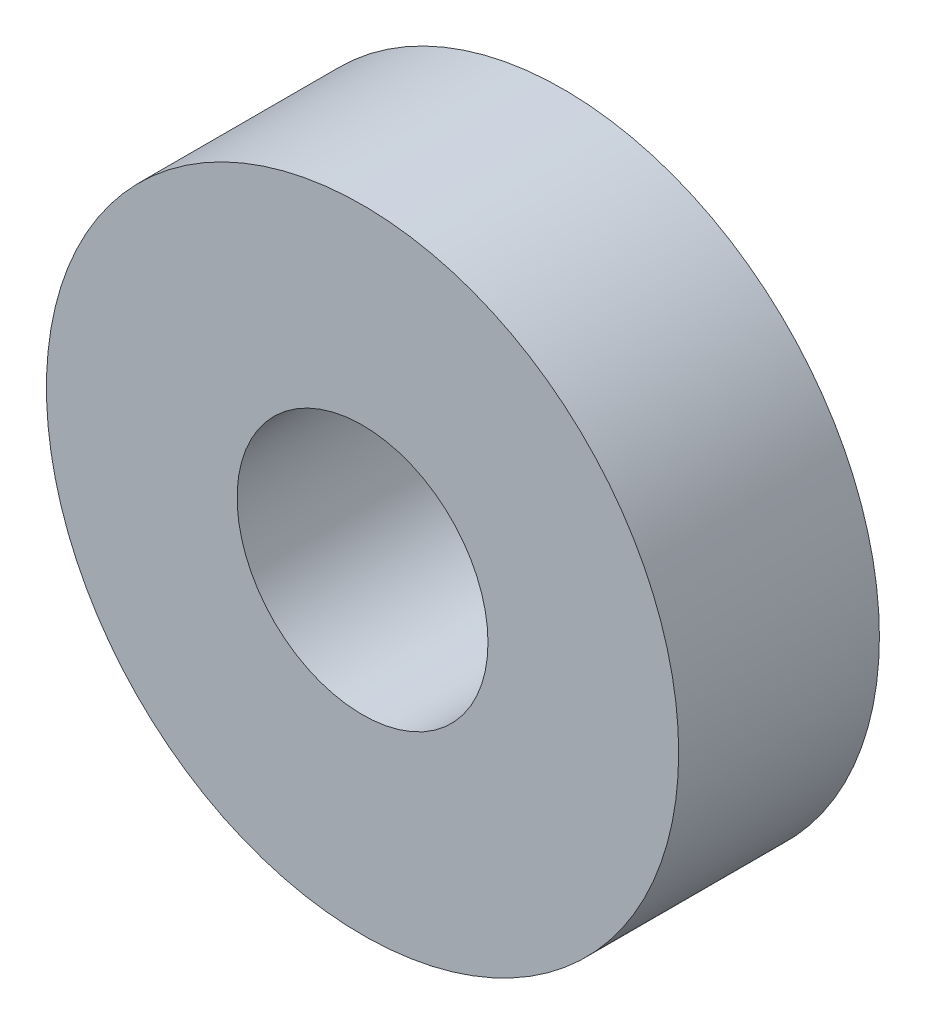
ISO-10303-21;
HEADER;
FILE_DESCRIPTION(('STEP AP214'),'2;1');
FILE_NAME('part.step','',(''),(''),'','','');
FILE_SCHEMA(('AUTOMOTIVE_DESIGN { 1 0 10303 214 1 1 1 1 }'));
ENDSEC;
DATA;
#1=APPLICATION_CONTEXT('core data for automotive mechanical design processes');
#2=APPLICATION_PROTOCOL_DEFINITION('international standard','automotive_design',2000,#1);
#3=PRODUCT_CONTEXT('',#1,'mechanical');
#4=PRODUCT('Part','Part','',(#3));
#5=PRODUCT_RELATED_PRODUCT_CATEGORY('part','',(#4));
#6=PRODUCT_DEFINITION_FORMATION('','',#4);
#7=PRODUCT_DEFINITION_CONTEXT('part definition',#1,'design');
#8=PRODUCT_DEFINITION('design','',#6,#7);
#9=PRODUCT_DEFINITION_SHAPE('','',#8);
#10=(LENGTH_UNIT() NAMED_UNIT(*) SI_UNIT(.MILLI.,.METRE.));
#11=(NAMED_UNIT(*) PLANE_ANGLE_UNIT() SI_UNIT($,.RADIAN.));
#12=(NAMED_UNIT(*) SI_UNIT($,.STERADIAN.) SOLID_ANGLE_UNIT());
#13=UNCERTAINTY_MEASURE_WITH_UNIT(LENGTH_MEASURE(1.E-05),#10,'distance_accuracy_value','');
#14=(GEOMETRIC_REPRESENTATION_CONTEXT(3) GLOBAL_UNCERTAINTY_ASSIGNED_CONTEXT((#13)) GLOBAL_UNIT_ASSIGNED_CONTEXT((#10,
#11,#12)) REPRESENTATION_CONTEXT('',''));
#15=CARTESIAN_POINT('',(0.,0.,0.));
#16=DIRECTION('',(0.,0.,1.));
#17=DIRECTION('',(1.,0.,0.));
#18=AXIS2_PLACEMENT_3D('',#15,#16,#17);
#19=CARTESIAN_POINT('',(0.,0.,10.));
#20=DIRECTION('',(0.,0.,1.));
#21=DIRECTION('',(1.,0.,0.));
#22=AXIS2_PLACEMENT_3D('',#19,#20,#21);
#23=PLANE('',#22);
#24=CARTESIAN_POINT('',(0.,0.,10.));
#25=DIRECTION('',(0.,0.,1.));
#26=DIRECTION('',(1.,0.,0.));
#27=AXIS2_PLACEMENT_3D('',#24,#25,#26);
#28=CIRCLE('',#27,15.75);
#29=CARTESIAN_POINT('',(15.75,0.,10.));
#30=VERTEX_POINT('',#29);
#31=EDGE_CURVE('E10',#30,#30,#28,.T.);
#32=ORIENTED_EDGE('',*,*,#31,.T.);
#33=EDGE_LOOP('',(#32));
#34=FACE_BOUND('',#33,.T.);
#35=CARTESIAN_POINT('',(0.,0.,10.));
#36=DIRECTION('',(0.,0.,1.));
#37=DIRECTION('',(1.,0.,0.));
#38=AXIS2_PLACEMENT_3D('',#35,#36,#37);
#39=CIRCLE('',#38,6.25);
#40=CARTESIAN_POINT('',(6.25,0.,10.));
#41=VERTEX_POINT('',#40);
#42=EDGE_CURVE('E41',#41,#41,#39,.T.);
#43=ORIENTED_EDGE('',*,*,#42,.F.);
#44=EDGE_LOOP('',(#43));
#45=FACE_BOUND('',#44,.T.);
#46=ADVANCED_FACE('F30',(#34,#45),#23,.T.);
#47=CARTESIAN_POINT('',(0.,0.,0.));
#48=DIRECTION('',(0.,0.,1.));
#49=DIRECTION('',(1.,0.,0.));
#50=AXIS2_PLACEMENT_3D('',#47,#48,#49);
#51=PLANE('',#50);
#52=CARTESIAN_POINT('',(0.,0.,0.));
#53=DIRECTION('',(0.,0.,1.));
#54=DIRECTION('',(1.,0.,0.));
#55=AXIS2_PLACEMENT_3D('',#52,#53,#54);
#56=CIRCLE('',#55,15.75);
#57=CARTESIAN_POINT('',(15.75,0.,0.));
#58=VERTEX_POINT('',#57);
#59=EDGE_CURVE('E34',#58,#58,#56,.T.);
#60=ORIENTED_EDGE('',*,*,#59,.F.);
#61=EDGE_LOOP('',(#60));
#62=FACE_BOUND('',#61,.T.);
#63=CARTESIAN_POINT('',(0.,0.,0.));
#64=DIRECTION('',(0.,0.,1.));
#65=DIRECTION('',(1.,0.,0.));
#66=AXIS2_PLACEMENT_3D('',#63,#64,#65);
#67=CIRCLE('',#66,6.25);
#68=CARTESIAN_POINT('',(6.25,0.,0.));
#69=VERTEX_POINT('',#68);
#70=EDGE_CURVE('E43',#69,#69,#67,.T.);
#71=ORIENTED_EDGE('',*,*,#70,.T.);
#72=EDGE_LOOP('',(#71));
#73=FACE_BOUND('',#72,.T.);
#74=ADVANCED_FACE('F53',(#62,#73),#51,.F.);
#75=CARTESIAN_POINT('',(0.,0.,10.));
#76=DIRECTION('',(0.,0.,-1.));
#77=DIRECTION('',(-1.,0.,0.));
#78=AXIS2_PLACEMENT_3D('',#75,#76,#77);
#79=CYLINDRICAL_SURFACE('',#78,15.75);
#80=ORIENTED_EDGE('',*,*,#31,.F.);
#81=EDGE_LOOP('',(#80));
#82=FACE_BOUND('',#81,.T.);
#83=ORIENTED_EDGE('',*,*,#59,.T.);
#84=EDGE_LOOP('',(#83));
#85=FACE_BOUND('',#84,.T.);
#86=ADVANCED_FACE('F32',(#82,#85),#79,.T.);
#87=CARTESIAN_POINT('',(0.,0.,10.));
#88=DIRECTION('',(0.,0.,-1.));
#89=DIRECTION('',(-1.,0.,0.));
#90=AXIS2_PLACEMENT_3D('',#87,#88,#89);
#91=CYLINDRICAL_SURFACE('',#90,6.25);
#92=ORIENTED_EDGE('',*,*,#42,.T.);
#93=EDGE_LOOP('',(#92));
#94=FACE_BOUND('',#93,.T.);
#95=ORIENTED_EDGE('',*,*,#70,.F.);
#96=EDGE_LOOP('',(#95));
#97=FACE_BOUND('',#96,.T.);
#98=ADVANCED_FACE('F49',(#94,#97),#91,.F.);
#99=CLOSED_SHELL('',(#46,#74,#86,#98));
#100=MANIFOLD_SOLID_BREP('B2',#99);
#101=ADVANCED_BREP_SHAPE_REPRESENTATION('',(#18,#100),#14);
#102=SHAPE_DEFINITION_REPRESENTATION(#9,#101);
ENDSEC;
END-ISO-10303-21;
